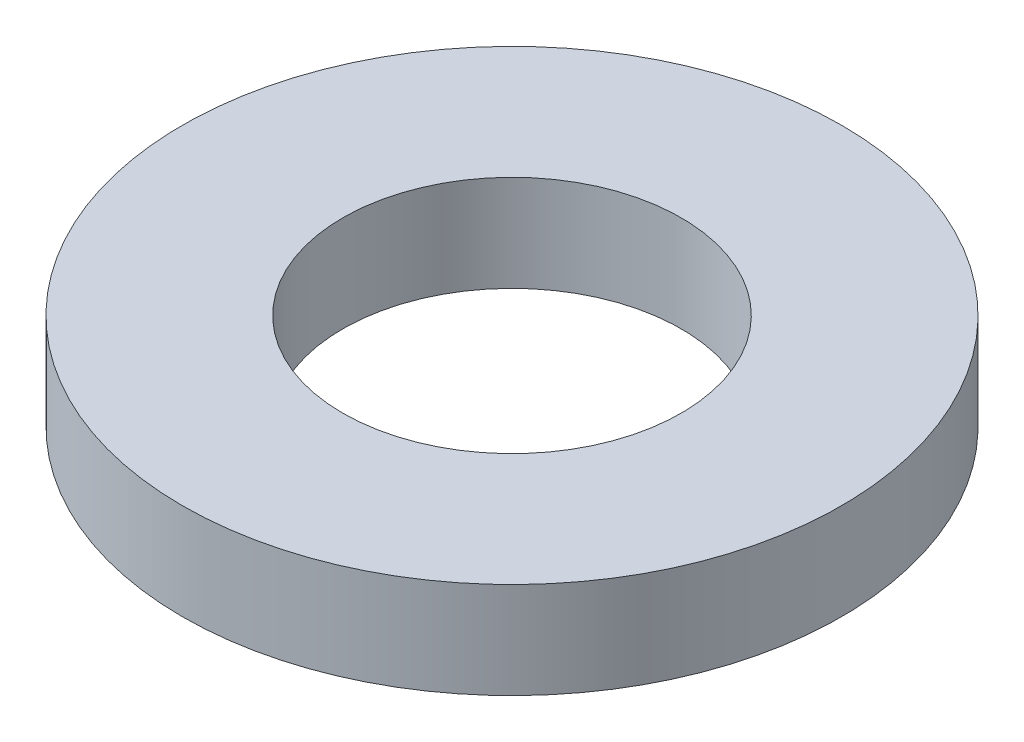
ISO-10303-21;
HEADER;
FILE_DESCRIPTION(('STEP AP214'),'2;1');
FILE_NAME('part.step','',(''),(''),'','','');
FILE_SCHEMA(('AUTOMOTIVE_DESIGN { 1 0 10303 214 1 1 1 1 }'));
ENDSEC;
DATA;
#1=APPLICATION_CONTEXT('core data for automotive mechanical design processes');
#2=APPLICATION_PROTOCOL_DEFINITION('international standard','automotive_design',2000,#1);
#3=PRODUCT_CONTEXT('',#1,'mechanical');
#4=PRODUCT('Part','Part','',(#3));
#5=PRODUCT_RELATED_PRODUCT_CATEGORY('part','',(#4));
#6=PRODUCT_DEFINITION_FORMATION('','',#4);
#7=PRODUCT_DEFINITION_CONTEXT('part definition',#1,'design');
#8=PRODUCT_DEFINITION('design','',#6,#7);
#9=PRODUCT_DEFINITION_SHAPE('','',#8);
#10=(LENGTH_UNIT() NAMED_UNIT(*) SI_UNIT(.MILLI.,.METRE.));
#11=(NAMED_UNIT(*) PLANE_ANGLE_UNIT() SI_UNIT($,.RADIAN.));
#12=(NAMED_UNIT(*) SI_UNIT($,.STERADIAN.) SOLID_ANGLE_UNIT());
#13=UNCERTAINTY_MEASURE_WITH_UNIT(LENGTH_MEASURE(1.E-05),#10,'distance_accuracy_value','');
#14=(GEOMETRIC_REPRESENTATION_CONTEXT(3) GLOBAL_UNCERTAINTY_ASSIGNED_CONTEXT((#13)) GLOBAL_UNIT_ASSIGNED_CONTEXT((#10,
#11,#12)) REPRESENTATION_CONTEXT('',''));
#15=CARTESIAN_POINT('',(0.,0.,0.));
#16=DIRECTION('',(0.,0.,1.));
#17=DIRECTION('',(1.,0.,0.));
#18=AXIS2_PLACEMENT_3D('',#15,#16,#17);
#19=CARTESIAN_POINT('',(0.,27.,0.));
#20=DIRECTION('',(0.,-1.,0.));
#21=DIRECTION('',(0.,0.,-1.));
#22=AXIS2_PLACEMENT_3D('',#19,#20,#21);
#23=CYLINDRICAL_SURFACE('',#22,92.5);
#24=CARTESIAN_POINT('',(0.,27.,0.));
#25=DIRECTION('',(0.,1.,0.));
#26=DIRECTION('',(0.,0.,1.));
#27=AXIS2_PLACEMENT_3D('',#24,#25,#26);
#28=CIRCLE('',#27,92.5);
#29=CARTESIAN_POINT('',(0.,27.,92.5));
#30=VERTEX_POINT('',#29);
#31=EDGE_CURVE('E10',#30,#30,#28,.T.);
#32=ORIENTED_EDGE('',*,*,#31,.F.);
#33=EDGE_LOOP('',(#32));
#34=FACE_BOUND('',#33,.T.);
#35=CARTESIAN_POINT('',(0.,0.,0.));
#36=DIRECTION('',(0.,1.,0.));
#37=DIRECTION('',(0.,0.,1.));
#38=AXIS2_PLACEMENT_3D('',#35,#36,#37);
#39=CIRCLE('',#38,92.5);
#40=CARTESIAN_POINT('',(0.,0.,92.5));
#41=VERTEX_POINT('',#40);
#42=EDGE_CURVE('E37',#41,#41,#39,.T.);
#43=ORIENTED_EDGE('',*,*,#42,.T.);
#44=EDGE_LOOP('',(#43));
#45=FACE_BOUND('',#44,.T.);
#46=ADVANCED_FACE('F40',(#34,#45),#23,.T.);
#47=CARTESIAN_POINT('',(0.,27.,0.));
#48=DIRECTION('',(0.,1.,0.));
#49=DIRECTION('',(0.,0.,1.));
#50=AXIS2_PLACEMENT_3D('',#47,#48,#49);
#51=PLANE('',#50);
#52=CARTESIAN_POINT('',(0.,27.,0.));
#53=DIRECTION('',(0.,1.,0.));
#54=DIRECTION('',(0.,0.,1.));
#55=AXIS2_PLACEMENT_3D('',#52,#53,#54);
#56=CIRCLE('',#55,47.5);
#57=CARTESIAN_POINT('',(0.,27.,47.5));
#58=VERTEX_POINT('',#57);
#59=EDGE_CURVE('E50',#58,#58,#56,.T.);
#60=ORIENTED_EDGE('',*,*,#59,.F.);
#61=EDGE_LOOP('',(#60));
#62=FACE_BOUND('',#61,.T.);
#63=ORIENTED_EDGE('',*,*,#31,.T.);
#64=EDGE_LOOP('',(#63));
#65=FACE_BOUND('',#64,.T.);
#66=ADVANCED_FACE('F59',(#62,#65),#51,.T.);
#67=CARTESIAN_POINT('',(0.,0.,0.));
#68=DIRECTION('',(0.,1.,0.));
#69=DIRECTION('',(0.,0.,1.));
#70=AXIS2_PLACEMENT_3D('',#67,#68,#69);
#71=PLANE('',#70);
#72=CARTESIAN_POINT('',(0.,0.,0.));
#73=DIRECTION('',(0.,1.,0.));
#74=DIRECTION('',(0.,0.,1.));
#75=AXIS2_PLACEMENT_3D('',#72,#73,#74);
#76=CIRCLE('',#75,47.5);
#77=CARTESIAN_POINT('',(0.,0.,47.5));
#78=VERTEX_POINT('',#77);
#79=EDGE_CURVE('E47',#78,#78,#76,.T.);
#80=ORIENTED_EDGE('',*,*,#79,.T.);
#81=EDGE_LOOP('',(#80));
#82=FACE_BOUND('',#81,.T.);
#83=ORIENTED_EDGE('',*,*,#42,.F.);
#84=EDGE_LOOP('',(#83));
#85=FACE_BOUND('',#84,.T.);
#86=ADVANCED_FACE('F58',(#82,#85),#71,.F.);
#87=CARTESIAN_POINT('',(0.,27.,0.));
#88=DIRECTION('',(0.,-1.,0.));
#89=DIRECTION('',(0.,0.,-1.));
#90=AXIS2_PLACEMENT_3D('',#87,#88,#89);
#91=CYLINDRICAL_SURFACE('',#90,47.5);
#92=ORIENTED_EDGE('',*,*,#59,.T.);
#93=EDGE_LOOP('',(#92));
#94=FACE_BOUND('',#93,.T.);
#95=ORIENTED_EDGE('',*,*,#79,.F.);
#96=EDGE_LOOP('',(#95));
#97=FACE_BOUND('',#96,.T.);
#98=ADVANCED_FACE('F54',(#94,#97),#91,.F.);
#99=CLOSED_SHELL('',(#46,#66,#86,#98));
#100=MANIFOLD_SOLID_BREP('B2',#99);
#101=ADVANCED_BREP_SHAPE_REPRESENTATION('',(#18,#100),#14);
#102=SHAPE_DEFINITION_REPRESENTATION(#9,#101);
ENDSEC;
END-ISO-10303-21;
